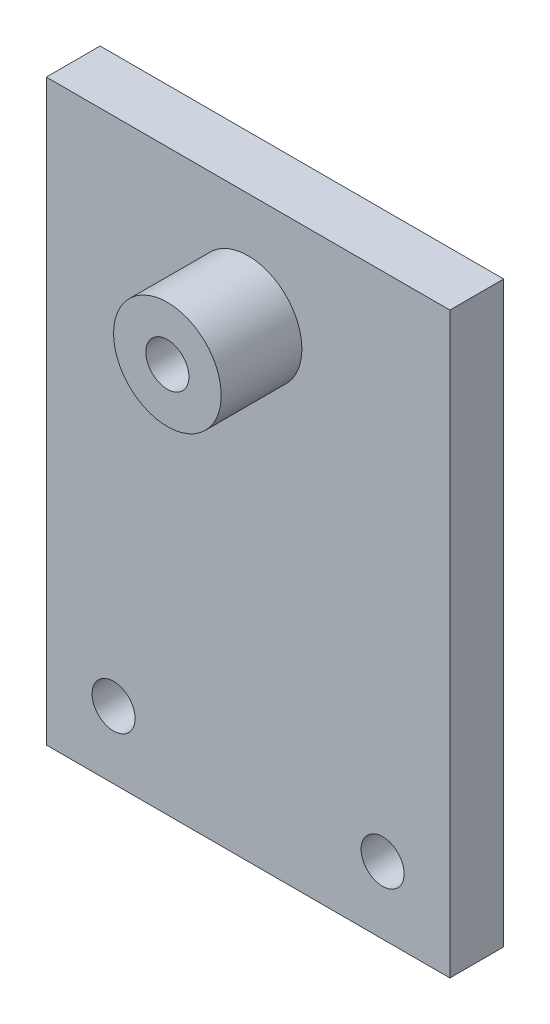
ISO-10303-21;
HEADER;
FILE_DESCRIPTION(('STEP AP214'),'2;1');
FILE_NAME('part.step','',(''),(''),'','','');
FILE_SCHEMA(('AUTOMOTIVE_DESIGN { 1 0 10303 214 1 1 1 1 }'));
ENDSEC;
DATA;
#1=APPLICATION_CONTEXT('core data for automotive mechanical design processes');
#2=APPLICATION_PROTOCOL_DEFINITION('international standard','automotive_design',2000,#1);
#3=PRODUCT_CONTEXT('',#1,'mechanical');
#4=PRODUCT('Part','Part','',(#3));
#5=PRODUCT_RELATED_PRODUCT_CATEGORY('part','',(#4));
#6=PRODUCT_DEFINITION_FORMATION('','',#4);
#7=PRODUCT_DEFINITION_CONTEXT('part definition',#1,'design');
#8=PRODUCT_DEFINITION('design','',#6,#7);
#9=PRODUCT_DEFINITION_SHAPE('','',#8);
#10=(LENGTH_UNIT() NAMED_UNIT(*) SI_UNIT(.MILLI.,.METRE.));
#11=(NAMED_UNIT(*) PLANE_ANGLE_UNIT() SI_UNIT($,.RADIAN.));
#12=(NAMED_UNIT(*) SI_UNIT($,.STERADIAN.) SOLID_ANGLE_UNIT());
#13=UNCERTAINTY_MEASURE_WITH_UNIT(LENGTH_MEASURE(1.E-05),#10,'distance_accuracy_value','');
#14=(GEOMETRIC_REPRESENTATION_CONTEXT(3) GLOBAL_UNCERTAINTY_ASSIGNED_CONTEXT((#13)) GLOBAL_UNIT_ASSIGNED_CONTEXT((#10,
#11,#12)) REPRESENTATION_CONTEXT('',''));
#15=CARTESIAN_POINT('',(0.,0.,0.));
#16=DIRECTION('',(0.,0.,1.));
#17=DIRECTION('',(1.,0.,0.));
#18=AXIS2_PLACEMENT_3D('',#15,#16,#17);
#19=CARTESIAN_POINT('',(0.,0.,4.));
#20=DIRECTION('',(0.,0.,-1.));
#21=DIRECTION('',(-1.,0.,0.));
#22=AXIS2_PLACEMENT_3D('',#19,#20,#21);
#23=PLANE('',#22);
#24=DIRECTION('',(1.,0.,0.));
#25=VECTOR('',#24,1.);
#26=CARTESIAN_POINT('',(-30.,3.15854884791912,4.));
#27=LINE('',#26,#25);
#28=CARTESIAN_POINT('',(-30.,3.15854884791912,4.));
#29=VERTEX_POINT('',#28);
#30=CARTESIAN_POINT('',(0.,3.15854884791912,4.));
#31=VERTEX_POINT('',#30);
#32=EDGE_CURVE('E131',#29,#31,#27,.T.);
#33=ORIENTED_EDGE('',*,*,#32,.T.);
#34=DIRECTION('',(0.,-1.,0.));
#35=VECTOR('',#34,1.);
#36=CARTESIAN_POINT('',(0.,46.1585488479191,4.));
#37=LINE('',#36,#35);
#38=CARTESIAN_POINT('',(0.,46.1585488479191,4.));
#39=VERTEX_POINT('',#38);
#40=EDGE_CURVE('E138',#39,#31,#37,.T.);
#41=ORIENTED_EDGE('',*,*,#40,.F.);
#42=DIRECTION('',(1.,0.,0.));
#43=VECTOR('',#42,1.);
#44=CARTESIAN_POINT('',(-30.,46.1585488479191,4.));
#45=LINE('',#44,#43);
#46=CARTESIAN_POINT('',(-30.,46.1585488479191,4.));
#47=VERTEX_POINT('',#46);
#48=EDGE_CURVE('E147',#47,#39,#45,.T.);
#49=ORIENTED_EDGE('',*,*,#48,.F.);
#50=DIRECTION('',(0.,-1.,0.));
#51=VECTOR('',#50,1.);
#52=CARTESIAN_POINT('',(-30.,46.1585488479191,4.));
#53=LINE('',#52,#51);
#54=EDGE_CURVE('E108',#47,#29,#53,.T.);
#55=ORIENTED_EDGE('',*,*,#54,.T.);
#56=EDGE_LOOP('',(#33,#41,#49,#55));
#57=FACE_BOUND('',#56,.T.);
#58=CARTESIAN_POINT('',(-15.,38.1585488479191,4.));
#59=DIRECTION('',(0.,0.,1.));
#60=DIRECTION('',(1.,0.,0.));
#61=AXIS2_PLACEMENT_3D('',#58,#59,#60);
#62=CIRCLE('',#61,4.00000000000001);
#63=CARTESIAN_POINT('',(-11.,38.1585488479191,4.));
#64=VERTEX_POINT('',#63);
#65=EDGE_CURVE('E162',#64,#64,#62,.T.);
#66=ORIENTED_EDGE('',*,*,#65,.F.);
#67=EDGE_LOOP('',(#66));
#68=FACE_BOUND('',#67,.T.);
#69=CARTESIAN_POINT('',(-25.,8.15854884791912,4.));
#70=DIRECTION('',(0.,0.,1.));
#71=DIRECTION('',(1.,0.,0.));
#72=AXIS2_PLACEMENT_3D('',#69,#70,#71);
#73=CIRCLE('',#72,1.6);
#74=CARTESIAN_POINT('',(-23.4,8.15854884791912,4.));
#75=VERTEX_POINT('',#74);
#76=EDGE_CURVE('E198',#75,#75,#73,.T.);
#77=ORIENTED_EDGE('',*,*,#76,.F.);
#78=EDGE_LOOP('',(#77));
#79=FACE_BOUND('',#78,.T.);
#80=CARTESIAN_POINT('',(-5.,8.15854884791912,4.));
#81=DIRECTION('',(0.,0.,1.));
#82=DIRECTION('',(1.,0.,0.));
#83=AXIS2_PLACEMENT_3D('',#80,#81,#82);
#84=CIRCLE('',#83,1.6);
#85=CARTESIAN_POINT('',(-3.4,8.15854884791912,4.));
#86=VERTEX_POINT('',#85);
#87=EDGE_CURVE('E186',#86,#86,#84,.T.);
#88=ORIENTED_EDGE('',*,*,#87,.F.);
#89=EDGE_LOOP('',(#88));
#90=FACE_BOUND('',#89,.T.);
#91=ADVANCED_FACE('F90',(#57,#68,#79,#90),#23,.F.);
#92=CARTESIAN_POINT('',(0.,0.,0.));
#93=DIRECTION('',(0.,0.,-1.));
#94=DIRECTION('',(-1.,0.,0.));
#95=AXIS2_PLACEMENT_3D('',#92,#93,#94);
#96=PLANE('',#95);
#97=CARTESIAN_POINT('',(-15.,38.1585488479191,0.));
#98=DIRECTION('',(0.,0.,1.));
#99=DIRECTION('',(1.,0.,0.));
#100=AXIS2_PLACEMENT_3D('',#97,#98,#99);
#101=CIRCLE('',#100,1.6);
#102=CARTESIAN_POINT('',(-13.4,38.1585488479191,0.));
#103=VERTEX_POINT('',#102);
#104=EDGE_CURVE('E195',#103,#103,#101,.T.);
#105=ORIENTED_EDGE('',*,*,#104,.T.);
#106=EDGE_LOOP('',(#105));
#107=FACE_BOUND('',#106,.T.);
#108=CARTESIAN_POINT('',(-25.,8.15854884791912,0.));
#109=DIRECTION('',(0.,0.,1.));
#110=DIRECTION('',(1.,0.,0.));
#111=AXIS2_PLACEMENT_3D('',#108,#109,#110);
#112=CIRCLE('',#111,1.6);
#113=CARTESIAN_POINT('',(-23.4,8.15854884791912,0.));
#114=VERTEX_POINT('',#113);
#115=EDGE_CURVE('E192',#114,#114,#112,.T.);
#116=ORIENTED_EDGE('',*,*,#115,.T.);
#117=EDGE_LOOP('',(#116));
#118=FACE_BOUND('',#117,.T.);
#119=DIRECTION('',(1.,0.,0.));
#120=VECTOR('',#119,1.);
#121=CARTESIAN_POINT('',(-30.,3.15854884791912,0.));
#122=LINE('',#121,#120);
#123=CARTESIAN_POINT('',(-30.,3.15854884791912,0.));
#124=VERTEX_POINT('',#123);
#125=CARTESIAN_POINT('',(0.,3.15854884791912,0.));
#126=VERTEX_POINT('',#125);
#127=EDGE_CURVE('E158',#124,#126,#122,.T.);
#128=ORIENTED_EDGE('',*,*,#127,.F.);
#129=DIRECTION('',(0.,-1.,0.));
#130=VECTOR('',#129,1.);
#131=CARTESIAN_POINT('',(-30.,46.1585488479191,0.));
#132=LINE('',#131,#130);
#133=CARTESIAN_POINT('',(-30.,46.1585488479191,0.));
#134=VERTEX_POINT('',#133);
#135=EDGE_CURVE('E126',#134,#124,#132,.T.);
#136=ORIENTED_EDGE('',*,*,#135,.F.);
#137=DIRECTION('',(1.,0.,0.));
#138=VECTOR('',#137,1.);
#139=CARTESIAN_POINT('',(-30.,46.1585488479191,0.));
#140=LINE('',#139,#138);
#141=CARTESIAN_POINT('',(0.,46.1585488479191,0.));
#142=VERTEX_POINT('',#141);
#143=EDGE_CURVE('E165',#134,#142,#140,.T.);
#144=ORIENTED_EDGE('',*,*,#143,.T.);
#145=DIRECTION('',(0.,-1.,0.));
#146=VECTOR('',#145,1.);
#147=CARTESIAN_POINT('',(0.,46.1585488479191,0.));
#148=LINE('',#147,#146);
#149=EDGE_CURVE('E140',#142,#126,#148,.T.);
#150=ORIENTED_EDGE('',*,*,#149,.T.);
#151=EDGE_LOOP('',(#128,#136,#144,#150));
#152=FACE_BOUND('',#151,.T.);
#153=CARTESIAN_POINT('',(-5.,8.15854884791912,0.));
#154=DIRECTION('',(0.,0.,1.));
#155=DIRECTION('',(1.,0.,0.));
#156=AXIS2_PLACEMENT_3D('',#153,#154,#155);
#157=CIRCLE('',#156,1.6);
#158=CARTESIAN_POINT('',(-3.4,8.15854884791912,0.));
#159=VERTEX_POINT('',#158);
#160=EDGE_CURVE('E183',#159,#159,#157,.T.);
#161=ORIENTED_EDGE('',*,*,#160,.T.);
#162=EDGE_LOOP('',(#161));
#163=FACE_BOUND('',#162,.T.);
#164=ADVANCED_FACE('F176',(#107,#118,#152,#163),#96,.T.);
#165=CARTESIAN_POINT('',(-30.,3.15854884791912,4.));
#166=DIRECTION('',(0.,1.,0.));
#167=DIRECTION('',(0.,0.,1.));
#168=AXIS2_PLACEMENT_3D('',#165,#166,#167);
#169=PLANE('',#168);
#170=ORIENTED_EDGE('',*,*,#127,.T.);
#171=DIRECTION('',(0.,0.,-1.));
#172=VECTOR('',#171,1.);
#173=CARTESIAN_POINT('',(0.,3.15854884791912,4.));
#174=LINE('',#173,#172);
#175=EDGE_CURVE('E12',#31,#126,#174,.T.);
#176=ORIENTED_EDGE('',*,*,#175,.F.);
#177=ORIENTED_EDGE('',*,*,#32,.F.);
#178=DIRECTION('',(0.,0.,-1.));
#179=VECTOR('',#178,1.);
#180=CARTESIAN_POINT('',(-30.,3.15854884791912,4.));
#181=LINE('',#180,#179);
#182=EDGE_CURVE('E154',#29,#124,#181,.T.);
#183=ORIENTED_EDGE('',*,*,#182,.T.);
#184=EDGE_LOOP('',(#170,#176,#177,#183));
#185=FACE_BOUND('',#184,.T.);
#186=ADVANCED_FACE('F92',(#185),#169,.F.);
#187=CARTESIAN_POINT('',(0.,46.1585488479191,4.));
#188=DIRECTION('',(1.,0.,0.));
#189=DIRECTION('',(0.,1.,0.));
#190=AXIS2_PLACEMENT_3D('',#187,#188,#189);
#191=PLANE('',#190);
#192=ORIENTED_EDGE('',*,*,#149,.F.);
#193=DIRECTION('',(0.,0.,-1.));
#194=VECTOR('',#193,1.);
#195=CARTESIAN_POINT('',(0.,46.1585488479191,4.));
#196=LINE('',#195,#194);
#197=EDGE_CURVE('E100',#39,#142,#196,.T.);
#198=ORIENTED_EDGE('',*,*,#197,.F.);
#199=ORIENTED_EDGE('',*,*,#40,.T.);
#200=ORIENTED_EDGE('',*,*,#175,.T.);
#201=EDGE_LOOP('',(#192,#198,#199,#200));
#202=FACE_BOUND('',#201,.T.);
#203=ADVANCED_FACE('F137',(#202),#191,.T.);
#204=CARTESIAN_POINT('',(-30.,46.1585488479191,4.));
#205=DIRECTION('',(0.,1.,0.));
#206=DIRECTION('',(-1.,0.,0.));
#207=AXIS2_PLACEMENT_3D('',#204,#205,#206);
#208=PLANE('',#207);
#209=ORIENTED_EDGE('',*,*,#143,.F.);
#210=DIRECTION('',(0.,0.,-1.));
#211=VECTOR('',#210,1.);
#212=CARTESIAN_POINT('',(-30.,46.1585488479191,4.));
#213=LINE('',#212,#211);
#214=EDGE_CURVE('E123',#47,#134,#213,.T.);
#215=ORIENTED_EDGE('',*,*,#214,.F.);
#216=ORIENTED_EDGE('',*,*,#48,.T.);
#217=ORIENTED_EDGE('',*,*,#197,.T.);
#218=EDGE_LOOP('',(#209,#215,#216,#217));
#219=FACE_BOUND('',#218,.T.);
#220=ADVANCED_FACE('F150',(#219),#208,.T.);
#221=CARTESIAN_POINT('',(-30.,46.1585488479191,4.));
#222=DIRECTION('',(1.,0.,0.));
#223=DIRECTION('',(0.,1.,0.));
#224=AXIS2_PLACEMENT_3D('',#221,#222,#223);
#225=PLANE('',#224);
#226=ORIENTED_EDGE('',*,*,#135,.T.);
#227=ORIENTED_EDGE('',*,*,#182,.F.);
#228=ORIENTED_EDGE('',*,*,#54,.F.);
#229=ORIENTED_EDGE('',*,*,#214,.T.);
#230=EDGE_LOOP('',(#226,#227,#228,#229));
#231=FACE_BOUND('',#230,.T.);
#232=ADVANCED_FACE('F229',(#231),#225,.F.);
#233=CARTESIAN_POINT('',(-25.,8.15854884791912,4.));
#234=DIRECTION('',(0.,0.,-1.));
#235=DIRECTION('',(-1.,0.,0.));
#236=AXIS2_PLACEMENT_3D('',#233,#234,#235);
#237=CYLINDRICAL_SURFACE('',#236,1.6);
#238=ORIENTED_EDGE('',*,*,#76,.T.);
#239=EDGE_LOOP('',(#238));
#240=FACE_BOUND('',#239,.T.);
#241=ORIENTED_EDGE('',*,*,#115,.F.);
#242=EDGE_LOOP('',(#241));
#243=FACE_BOUND('',#242,.T.);
#244=ADVANCED_FACE('F220',(#240,#243),#237,.F.);
#245=CARTESIAN_POINT('',(-5.,8.15854884791912,4.));
#246=DIRECTION('',(0.,0.,-1.));
#247=DIRECTION('',(-1.,0.,0.));
#248=AXIS2_PLACEMENT_3D('',#245,#246,#247);
#249=CYLINDRICAL_SURFACE('',#248,1.6);
#250=ORIENTED_EDGE('',*,*,#87,.T.);
#251=EDGE_LOOP('',(#250));
#252=FACE_BOUND('',#251,.T.);
#253=ORIENTED_EDGE('',*,*,#160,.F.);
#254=EDGE_LOOP('',(#253));
#255=FACE_BOUND('',#254,.T.);
#256=ADVANCED_FACE('F218',(#252,#255),#249,.F.);
#257=CARTESIAN_POINT('',(-15.,38.1585488479191,10.));
#258=DIRECTION('',(0.,0.,-1.));
#259=DIRECTION('',(-1.,0.,0.));
#260=AXIS2_PLACEMENT_3D('',#257,#258,#259);
#261=CYLINDRICAL_SURFACE('',#260,4.);
#262=CARTESIAN_POINT('',(-15.,38.1585488479191,10.));
#263=DIRECTION('',(0.,0.,-1.));
#264=DIRECTION('',(-1.,0.,0.));
#265=AXIS2_PLACEMENT_3D('',#262,#263,#264);
#266=CIRCLE('',#265,4.);
#267=CARTESIAN_POINT('',(-19.,38.1585488479191,10.));
#268=VERTEX_POINT('',#267);
#269=EDGE_CURVE('E187',#268,#268,#266,.T.);
#270=ORIENTED_EDGE('',*,*,#269,.T.);
#271=EDGE_LOOP('',(#270));
#272=FACE_BOUND('',#271,.T.);
#273=ORIENTED_EDGE('',*,*,#65,.T.);
#274=EDGE_LOOP('',(#273));
#275=FACE_BOUND('',#274,.T.);
#276=ADVANCED_FACE('F210',(#272,#275),#261,.T.);
#277=CARTESIAN_POINT('',(-15.,38.1585488479191,10.));
#278=DIRECTION('',(0.,0.,-1.));
#279=DIRECTION('',(-1.,0.,0.));
#280=AXIS2_PLACEMENT_3D('',#277,#278,#279);
#281=PLANE('',#280);
#282=CARTESIAN_POINT('',(-15.,38.1585488479191,10.));
#283=DIRECTION('',(0.,0.,1.));
#284=DIRECTION('',(1.,0.,0.));
#285=AXIS2_PLACEMENT_3D('',#282,#283,#284);
#286=CIRCLE('',#285,1.6);
#287=CARTESIAN_POINT('',(-13.4,38.1585488479191,10.));
#288=VERTEX_POINT('',#287);
#289=EDGE_CURVE('E294',#288,#288,#286,.T.);
#290=ORIENTED_EDGE('',*,*,#289,.F.);
#291=EDGE_LOOP('',(#290));
#292=FACE_BOUND('',#291,.T.);
#293=ORIENTED_EDGE('',*,*,#269,.F.);
#294=EDGE_LOOP('',(#293));
#295=FACE_BOUND('',#294,.T.);
#296=ADVANCED_FACE('F226',(#292,#295),#281,.F.);
#297=CARTESIAN_POINT('',(-15.,38.1585488479191,0.));
#298=DIRECTION('',(0.,0.,1.));
#299=DIRECTION('',(1.,0.,0.));
#300=AXIS2_PLACEMENT_3D('',#297,#298,#299);
#301=CYLINDRICAL_SURFACE('',#300,1.6);
#302=ORIENTED_EDGE('',*,*,#104,.F.);
#303=EDGE_LOOP('',(#302));
#304=FACE_BOUND('',#303,.T.);
#305=ORIENTED_EDGE('',*,*,#289,.T.);
#306=EDGE_LOOP('',(#305));
#307=FACE_BOUND('',#306,.T.);
#308=ADVANCED_FACE('F277',(#304,#307),#301,.F.);
#309=CLOSED_SHELL('',(#91,#164,#186,#203,#220,#232,#244,#256,#276,#296,#308));
#310=MANIFOLD_SOLID_BREP('B2',#309);
#311=ADVANCED_BREP_SHAPE_REPRESENTATION('',(#18,#310),#14);
#312=SHAPE_DEFINITION_REPRESENTATION(#9,#311);
ENDSEC;
END-ISO-10303-21;
